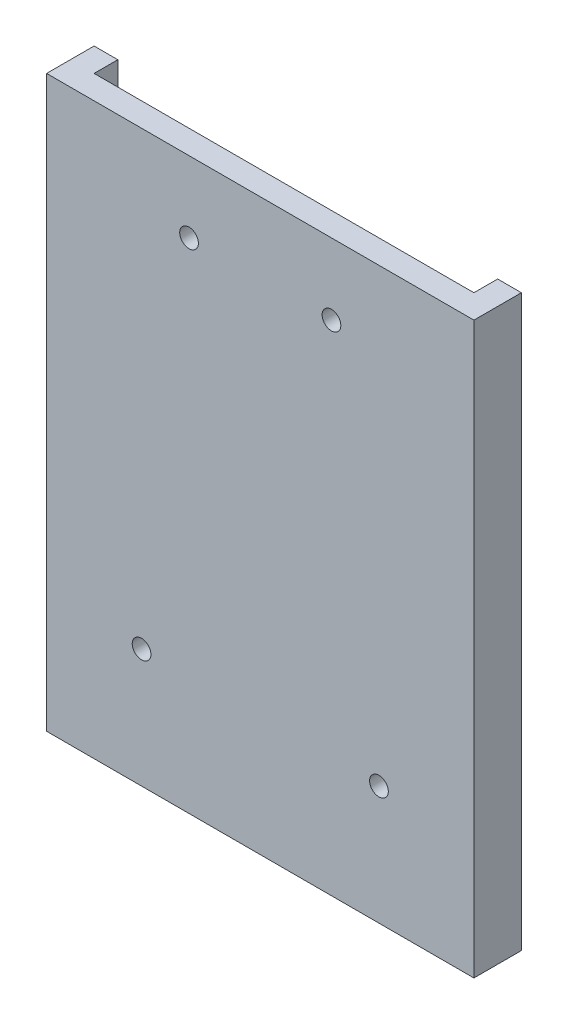
ISO-10303-21;
HEADER;
FILE_DESCRIPTION(('STEP AP214'),'2;1');
FILE_NAME('part.step','',(''),(''),'','','');
FILE_SCHEMA(('AUTOMOTIVE_DESIGN { 1 0 10303 214 1 1 1 1 }'));
ENDSEC;
DATA;
#1=APPLICATION_CONTEXT('core data for automotive mechanical design processes');
#2=APPLICATION_PROTOCOL_DEFINITION('international standard','automotive_design',2000,#1);
#3=PRODUCT_CONTEXT('',#1,'mechanical');
#4=PRODUCT('Part','Part','',(#3));
#5=PRODUCT_RELATED_PRODUCT_CATEGORY('part','',(#4));
#6=PRODUCT_DEFINITION_FORMATION('','',#4);
#7=PRODUCT_DEFINITION_CONTEXT('part definition',#1,'design');
#8=PRODUCT_DEFINITION('design','',#6,#7);
#9=PRODUCT_DEFINITION_SHAPE('','',#8);
#10=(LENGTH_UNIT() NAMED_UNIT(*) SI_UNIT(.MILLI.,.METRE.));
#11=(NAMED_UNIT(*) PLANE_ANGLE_UNIT() SI_UNIT($,.RADIAN.));
#12=(NAMED_UNIT(*) SI_UNIT($,.STERADIAN.) SOLID_ANGLE_UNIT());
#13=UNCERTAINTY_MEASURE_WITH_UNIT(LENGTH_MEASURE(1.E-05),#10,'distance_accuracy_value','');
#14=(GEOMETRIC_REPRESENTATION_CONTEXT(3) GLOBAL_UNCERTAINTY_ASSIGNED_CONTEXT((#13)) GLOBAL_UNIT_ASSIGNED_CONTEXT((#10,
#11,#12)) REPRESENTATION_CONTEXT('',''));
#15=CARTESIAN_POINT('',(0.,0.,0.));
#16=DIRECTION('',(0.,0.,1.));
#17=DIRECTION('',(1.,0.,0.));
#18=AXIS2_PLACEMENT_3D('',#15,#16,#17);
#19=CARTESIAN_POINT('',(28.575,76.2,-3.175));
#20=DIRECTION('',(-1.,0.,0.));
#21=DIRECTION('',(0.,0.,1.));
#22=AXIS2_PLACEMENT_3D('',#19,#20,#21);
#23=PLANE('',#22);
#24=DIRECTION('',(0.,0.,-1.));
#25=VECTOR('',#24,1.);
#26=CARTESIAN_POINT('',(28.575,0.,-3.175));
#27=LINE('',#26,#25);
#28=CARTESIAN_POINT('',(28.575,0.,3.175));
#29=VERTEX_POINT('',#28);
#30=CARTESIAN_POINT('',(28.575,0.,-3.175));
#31=VERTEX_POINT('',#30);
#32=EDGE_CURVE('E135',#29,#31,#27,.T.);
#33=ORIENTED_EDGE('',*,*,#32,.T.);
#34=DIRECTION('',(0.,-1.,0.));
#35=VECTOR('',#34,1.);
#36=CARTESIAN_POINT('',(28.575,76.2,-3.175));
#37=LINE('',#36,#35);
#38=CARTESIAN_POINT('',(28.575,76.2,-3.175));
#39=VERTEX_POINT('',#38);
#40=EDGE_CURVE('E12',#39,#31,#37,.T.);
#41=ORIENTED_EDGE('',*,*,#40,.F.);
#42=DIRECTION('',(0.,0.,-1.));
#43=VECTOR('',#42,1.);
#44=CARTESIAN_POINT('',(28.575,76.2,-3.175));
#45=LINE('',#44,#43);
#46=CARTESIAN_POINT('',(28.575,76.2,3.175));
#47=VERTEX_POINT('',#46);
#48=EDGE_CURVE('E137',#47,#39,#45,.T.);
#49=ORIENTED_EDGE('',*,*,#48,.F.);
#50=DIRECTION('',(0.,-1.,0.));
#51=VECTOR('',#50,1.);
#52=CARTESIAN_POINT('',(28.575,76.2,3.175));
#53=LINE('',#52,#51);
#54=EDGE_CURVE('E144',#47,#29,#53,.T.);
#55=ORIENTED_EDGE('',*,*,#54,.T.);
#56=EDGE_LOOP('',(#33,#41,#49,#55));
#57=FACE_BOUND('',#56,.T.);
#58=ADVANCED_FACE('F35',(#57),#23,.F.);
#59=CARTESIAN_POINT('',(-28.575,76.2,-3.175));
#60=DIRECTION('',(0.,0.,1.));
#61=DIRECTION('',(1.,0.,0.));
#62=AXIS2_PLACEMENT_3D('',#59,#60,#61);
#63=PLANE('',#62);
#64=DIRECTION('',(-1.,0.,0.));
#65=VECTOR('',#64,1.);
#66=CARTESIAN_POINT('',(-28.575,76.2,-3.175));
#67=LINE('',#66,#65);
#68=CARTESIAN_POINT('',(-25.4,76.2,-3.175));
#69=VERTEX_POINT('',#68);
#70=CARTESIAN_POINT('',(-28.575,76.2,-3.175));
#71=VERTEX_POINT('',#70);
#72=EDGE_CURVE('E139',#69,#71,#67,.T.);
#73=ORIENTED_EDGE('',*,*,#72,.F.);
#74=DIRECTION('',(0.,1.,0.));
#75=VECTOR('',#74,1.);
#76=CARTESIAN_POINT('',(-25.4,-50.8991220454734,-3.175));
#77=LINE('',#76,#75);
#78=CARTESIAN_POINT('',(-25.4,3.175,-3.175));
#79=VERTEX_POINT('',#78);
#80=EDGE_CURVE('E130',#79,#69,#77,.T.);
#81=ORIENTED_EDGE('',*,*,#80,.F.);
#82=DIRECTION('',(1.,0.,0.));
#83=VECTOR('',#82,1.);
#84=CARTESIAN_POINT('',(-25.4,3.175,-3.175));
#85=LINE('',#84,#83);
#86=CARTESIAN_POINT('',(25.4,3.175,-3.175));
#87=VERTEX_POINT('',#86);
#88=EDGE_CURVE('E196',#79,#87,#85,.T.);
#89=ORIENTED_EDGE('',*,*,#88,.T.);
#90=DIRECTION('',(0.,1.,0.));
#91=VECTOR('',#90,1.);
#92=CARTESIAN_POINT('',(25.4,-50.8991220454734,-3.175));
#93=LINE('',#92,#91);
#94=CARTESIAN_POINT('',(25.4,76.2,-3.175));
#95=VERTEX_POINT('',#94);
#96=EDGE_CURVE('E118',#87,#95,#93,.T.);
#97=ORIENTED_EDGE('',*,*,#96,.T.);
#98=EDGE_CURVE('E86',#39,#95,#67,.T.);
#99=ORIENTED_EDGE('',*,*,#98,.F.);
#100=ORIENTED_EDGE('',*,*,#40,.T.);
#101=DIRECTION('',(-1.,0.,0.));
#102=VECTOR('',#101,1.);
#103=CARTESIAN_POINT('',(-28.575,0.,-3.175));
#104=LINE('',#103,#102);
#105=CARTESIAN_POINT('',(-28.575,0.,-3.175));
#106=VERTEX_POINT('',#105);
#107=EDGE_CURVE('E147',#31,#106,#104,.T.);
#108=ORIENTED_EDGE('',*,*,#107,.T.);
#109=DIRECTION('',(0.,-1.,0.));
#110=VECTOR('',#109,1.);
#111=CARTESIAN_POINT('',(-28.575,76.2,-3.175));
#112=LINE('',#111,#110);
#113=EDGE_CURVE('E42',#71,#106,#112,.T.);
#114=ORIENTED_EDGE('',*,*,#113,.F.);
#115=EDGE_LOOP('',(#73,#81,#89,#97,#99,#100,#108,#114));
#116=FACE_BOUND('',#115,.T.);
#117=ADVANCED_FACE('F177',(#116),#63,.F.);
#118=CARTESIAN_POINT('',(-28.575,76.2,-3.175));
#119=DIRECTION('',(1.,0.,0.));
#120=DIRECTION('',(0.,0.,-1.));
#121=AXIS2_PLACEMENT_3D('',#118,#119,#120);
#122=PLANE('',#121);
#123=DIRECTION('',(0.,0.,1.));
#124=VECTOR('',#123,1.);
#125=CARTESIAN_POINT('',(-28.575,0.,-3.175));
#126=LINE('',#125,#124);
#127=CARTESIAN_POINT('',(-28.575,0.,3.175));
#128=VERTEX_POINT('',#127);
#129=EDGE_CURVE('E149',#106,#128,#126,.T.);
#130=ORIENTED_EDGE('',*,*,#129,.T.);
#131=DIRECTION('',(0.,-1.,0.));
#132=VECTOR('',#131,1.);
#133=CARTESIAN_POINT('',(-28.575,76.2,3.175));
#134=LINE('',#133,#132);
#135=CARTESIAN_POINT('',(-28.575,76.2,3.175));
#136=VERTEX_POINT('',#135);
#137=EDGE_CURVE('E153',#136,#128,#134,.T.);
#138=ORIENTED_EDGE('',*,*,#137,.F.);
#139=DIRECTION('',(0.,0.,1.));
#140=VECTOR('',#139,1.);
#141=CARTESIAN_POINT('',(-28.575,76.2,-3.175));
#142=LINE('',#141,#140);
#143=EDGE_CURVE('E141',#71,#136,#142,.T.);
#144=ORIENTED_EDGE('',*,*,#143,.F.);
#145=ORIENTED_EDGE('',*,*,#113,.T.);
#146=EDGE_LOOP('',(#130,#138,#144,#145));
#147=FACE_BOUND('',#146,.T.);
#148=ADVANCED_FACE('F159',(#147),#122,.F.);
#149=CARTESIAN_POINT('',(-28.575,76.2,3.175));
#150=DIRECTION('',(0.,0.,-1.));
#151=DIRECTION('',(-1.,0.,0.));
#152=AXIS2_PLACEMENT_3D('',#149,#150,#151);
#153=PLANE('',#152);
#154=CARTESIAN_POINT('',(-15.875,15.875,3.175));
#155=DIRECTION('',(0.,0.,-1.));
#156=DIRECTION('',(-1.,0.,0.));
#157=AXIS2_PLACEMENT_3D('',#154,#155,#156);
#158=CIRCLE('',#157,1.25);
#159=CARTESIAN_POINT('',(-17.125,15.875,3.175));
#160=VERTEX_POINT('',#159);
#161=EDGE_CURVE('E205',#160,#160,#158,.T.);
#162=ORIENTED_EDGE('',*,*,#161,.T.);
#163=EDGE_LOOP('',(#162));
#164=FACE_BOUND('',#163,.T.);
#165=CARTESIAN_POINT('',(15.875,15.875,3.175));
#166=DIRECTION('',(0.,0.,-1.));
#167=DIRECTION('',(-1.,0.,0.));
#168=AXIS2_PLACEMENT_3D('',#165,#166,#167);
#169=CIRCLE('',#168,1.25);
#170=CARTESIAN_POINT('',(14.625,15.875,3.175));
#171=VERTEX_POINT('',#170);
#172=EDGE_CURVE('E210',#171,#171,#169,.T.);
#173=ORIENTED_EDGE('',*,*,#172,.T.);
#174=EDGE_LOOP('',(#173));
#175=FACE_BOUND('',#174,.T.);
#176=CARTESIAN_POINT('',(-9.52499999999999,66.675,3.175));
#177=DIRECTION('',(0.,0.,-1.));
#178=DIRECTION('',(-1.,0.,0.));
#179=AXIS2_PLACEMENT_3D('',#176,#177,#178);
#180=CIRCLE('',#179,1.25);
#181=CARTESIAN_POINT('',(-10.775,66.675,3.175));
#182=VERTEX_POINT('',#181);
#183=EDGE_CURVE('E200',#182,#182,#180,.T.);
#184=ORIENTED_EDGE('',*,*,#183,.T.);
#185=EDGE_LOOP('',(#184));
#186=FACE_BOUND('',#185,.T.);
#187=CARTESIAN_POINT('',(9.52500000000001,66.675,3.175));
#188=DIRECTION('',(0.,0.,-1.));
#189=DIRECTION('',(-1.,0.,0.));
#190=AXIS2_PLACEMENT_3D('',#187,#188,#189);
#191=CIRCLE('',#190,1.25);
#192=CARTESIAN_POINT('',(8.27500000000001,66.675,3.175));
#193=VERTEX_POINT('',#192);
#194=EDGE_CURVE('E190',#193,#193,#191,.T.);
#195=ORIENTED_EDGE('',*,*,#194,.T.);
#196=EDGE_LOOP('',(#195));
#197=FACE_BOUND('',#196,.T.);
#198=DIRECTION('',(1.,0.,0.));
#199=VECTOR('',#198,1.);
#200=CARTESIAN_POINT('',(-28.575,0.,3.175));
#201=LINE('',#200,#199);
#202=EDGE_CURVE('E79',#128,#29,#201,.T.);
#203=ORIENTED_EDGE('',*,*,#202,.T.);
#204=ORIENTED_EDGE('',*,*,#54,.F.);
#205=DIRECTION('',(1.,0.,0.));
#206=VECTOR('',#205,1.);
#207=CARTESIAN_POINT('',(-28.575,76.2,3.175));
#208=LINE('',#207,#206);
#209=EDGE_CURVE('E58',#136,#47,#208,.T.);
#210=ORIENTED_EDGE('',*,*,#209,.F.);
#211=ORIENTED_EDGE('',*,*,#137,.T.);
#212=EDGE_LOOP('',(#203,#204,#210,#211));
#213=FACE_BOUND('',#212,.T.);
#214=ADVANCED_FACE('F168',(#164,#175,#186,#197,#213),#153,.F.);
#215=CARTESIAN_POINT('',(0.,76.2,0.));
#216=DIRECTION('',(0.,1.,0.));
#217=DIRECTION('',(0.,0.,1.));
#218=AXIS2_PLACEMENT_3D('',#215,#216,#217);
#219=PLANE('',#218);
#220=DIRECTION('',(0.,0.,1.));
#221=VECTOR('',#220,1.);
#222=CARTESIAN_POINT('',(-25.4,76.2,-3.175));
#223=LINE('',#222,#221);
#224=CARTESIAN_POINT('',(-25.4,76.2,0.));
#225=VERTEX_POINT('',#224);
#226=EDGE_CURVE('E49',#69,#225,#223,.T.);
#227=ORIENTED_EDGE('',*,*,#226,.F.);
#228=ORIENTED_EDGE('',*,*,#72,.T.);
#229=ORIENTED_EDGE('',*,*,#143,.T.);
#230=ORIENTED_EDGE('',*,*,#209,.T.);
#231=ORIENTED_EDGE('',*,*,#48,.T.);
#232=ORIENTED_EDGE('',*,*,#98,.T.);
#233=DIRECTION('',(0.,0.,-1.));
#234=VECTOR('',#233,1.);
#235=CARTESIAN_POINT('',(25.4,76.2,-3.175));
#236=LINE('',#235,#234);
#237=CARTESIAN_POINT('',(25.4,76.2,0.));
#238=VERTEX_POINT('',#237);
#239=EDGE_CURVE('E114',#238,#95,#236,.T.);
#240=ORIENTED_EDGE('',*,*,#239,.F.);
#241=DIRECTION('',(1.,0.,0.));
#242=VECTOR('',#241,1.);
#243=CARTESIAN_POINT('',(-25.4,76.2,0.));
#244=LINE('',#243,#242);
#245=EDGE_CURVE('E122',#225,#238,#244,.T.);
#246=ORIENTED_EDGE('',*,*,#245,.F.);
#247=EDGE_LOOP('',(#227,#228,#229,#230,#231,#232,#240,#246));
#248=FACE_BOUND('',#247,.T.);
#249=ADVANCED_FACE('F125',(#248),#219,.T.);
#250=CARTESIAN_POINT('',(0.,0.,0.));
#251=DIRECTION('',(0.,1.,0.));
#252=DIRECTION('',(0.,0.,1.));
#253=AXIS2_PLACEMENT_3D('',#250,#251,#252);
#254=PLANE('',#253);
#255=ORIENTED_EDGE('',*,*,#32,.F.);
#256=ORIENTED_EDGE('',*,*,#202,.F.);
#257=ORIENTED_EDGE('',*,*,#129,.F.);
#258=ORIENTED_EDGE('',*,*,#107,.F.);
#259=EDGE_LOOP('',(#255,#256,#257,#258));
#260=FACE_BOUND('',#259,.T.);
#261=ADVANCED_FACE('F164',(#260),#254,.F.);
#262=CARTESIAN_POINT('',(-25.4,-50.8991220454734,-3.175));
#263=DIRECTION('',(-1.,0.,0.));
#264=DIRECTION('',(0.,0.,1.));
#265=AXIS2_PLACEMENT_3D('',#262,#263,#264);
#266=PLANE('',#265);
#267=DIRECTION('',(0.,0.,-1.));
#268=VECTOR('',#267,1.);
#269=CARTESIAN_POINT('',(-25.4,3.175,-3.175));
#270=LINE('',#269,#268);
#271=CARTESIAN_POINT('',(-25.4,3.175,0.));
#272=VERTEX_POINT('',#271);
#273=EDGE_CURVE('E136',#272,#79,#270,.T.);
#274=ORIENTED_EDGE('',*,*,#273,.T.);
#275=ORIENTED_EDGE('',*,*,#80,.T.);
#276=ORIENTED_EDGE('',*,*,#226,.T.);
#277=DIRECTION('',(0.,1.,0.));
#278=VECTOR('',#277,1.);
#279=CARTESIAN_POINT('',(-25.4,-50.8991220454734,0.));
#280=LINE('',#279,#278);
#281=EDGE_CURVE('E119',#272,#225,#280,.T.);
#282=ORIENTED_EDGE('',*,*,#281,.F.);
#283=EDGE_LOOP('',(#274,#275,#276,#282));
#284=FACE_BOUND('',#283,.T.);
#285=ADVANCED_FACE('F250',(#284),#266,.F.);
#286=CARTESIAN_POINT('',(25.4,-50.8991220454734,-3.175));
#287=DIRECTION('',(1.,0.,0.));
#288=DIRECTION('',(0.,0.,-1.));
#289=AXIS2_PLACEMENT_3D('',#286,#287,#288);
#290=PLANE('',#289);
#291=DIRECTION('',(0.,0.,1.));
#292=VECTOR('',#291,1.);
#293=CARTESIAN_POINT('',(25.4,3.175,-3.175));
#294=LINE('',#293,#292);
#295=CARTESIAN_POINT('',(25.4,3.175,0.));
#296=VERTEX_POINT('',#295);
#297=EDGE_CURVE('E115',#87,#296,#294,.T.);
#298=ORIENTED_EDGE('',*,*,#297,.T.);
#299=DIRECTION('',(0.,1.,0.));
#300=VECTOR('',#299,1.);
#301=CARTESIAN_POINT('',(25.4,-50.8991220454734,0.));
#302=LINE('',#301,#300);
#303=EDGE_CURVE('E109',#296,#238,#302,.T.);
#304=ORIENTED_EDGE('',*,*,#303,.T.);
#305=ORIENTED_EDGE('',*,*,#239,.T.);
#306=ORIENTED_EDGE('',*,*,#96,.F.);
#307=EDGE_LOOP('',(#298,#304,#305,#306));
#308=FACE_BOUND('',#307,.T.);
#309=ADVANCED_FACE('F111',(#308),#290,.F.);
#310=CARTESIAN_POINT('',(-25.4,-50.8991220454734,0.));
#311=DIRECTION('',(0.,0.,1.));
#312=DIRECTION('',(1.,0.,0.));
#313=AXIS2_PLACEMENT_3D('',#310,#311,#312);
#314=PLANE('',#313);
#315=CARTESIAN_POINT('',(-15.875,15.875,0.));
#316=DIRECTION('',(0.,0.,-1.));
#317=DIRECTION('',(-1.,0.,0.));
#318=AXIS2_PLACEMENT_3D('',#315,#316,#317);
#319=CIRCLE('',#318,1.25);
#320=CARTESIAN_POINT('',(-17.125,15.875,0.));
#321=VERTEX_POINT('',#320);
#322=EDGE_CURVE('E202',#321,#321,#319,.T.);
#323=ORIENTED_EDGE('',*,*,#322,.F.);
#324=EDGE_LOOP('',(#323));
#325=FACE_BOUND('',#324,.T.);
#326=CARTESIAN_POINT('',(15.875,15.875,0.));
#327=DIRECTION('',(0.,0.,-1.));
#328=DIRECTION('',(-1.,0.,0.));
#329=AXIS2_PLACEMENT_3D('',#326,#327,#328);
#330=CIRCLE('',#329,1.25);
#331=CARTESIAN_POINT('',(14.625,15.875,0.));
#332=VERTEX_POINT('',#331);
#333=EDGE_CURVE('E207',#332,#332,#330,.T.);
#334=ORIENTED_EDGE('',*,*,#333,.F.);
#335=EDGE_LOOP('',(#334));
#336=FACE_BOUND('',#335,.T.);
#337=CARTESIAN_POINT('',(-9.52499999999999,66.675,0.));
#338=DIRECTION('',(0.,0.,-1.));
#339=DIRECTION('',(-1.,0.,0.));
#340=AXIS2_PLACEMENT_3D('',#337,#338,#339);
#341=CIRCLE('',#340,1.25);
#342=CARTESIAN_POINT('',(-10.775,66.675,0.));
#343=VERTEX_POINT('',#342);
#344=EDGE_CURVE('E213',#343,#343,#341,.T.);
#345=ORIENTED_EDGE('',*,*,#344,.F.);
#346=EDGE_LOOP('',(#345));
#347=FACE_BOUND('',#346,.T.);
#348=CARTESIAN_POINT('',(9.52500000000001,66.675,0.));
#349=DIRECTION('',(0.,0.,-1.));
#350=DIRECTION('',(-1.,0.,0.));
#351=AXIS2_PLACEMENT_3D('',#348,#349,#350);
#352=CIRCLE('',#351,1.25);
#353=CARTESIAN_POINT('',(8.27500000000001,66.675,0.));
#354=VERTEX_POINT('',#353);
#355=EDGE_CURVE('E192',#354,#354,#352,.T.);
#356=ORIENTED_EDGE('',*,*,#355,.F.);
#357=EDGE_LOOP('',(#356));
#358=FACE_BOUND('',#357,.T.);
#359=DIRECTION('',(-1.,0.,0.));
#360=VECTOR('',#359,1.);
#361=CARTESIAN_POINT('',(-25.4,3.175,0.));
#362=LINE('',#361,#360);
#363=EDGE_CURVE('E133',#296,#272,#362,.T.);
#364=ORIENTED_EDGE('',*,*,#363,.T.);
#365=ORIENTED_EDGE('',*,*,#281,.T.);
#366=ORIENTED_EDGE('',*,*,#245,.T.);
#367=ORIENTED_EDGE('',*,*,#303,.F.);
#368=EDGE_LOOP('',(#364,#365,#366,#367));
#369=FACE_BOUND('',#368,.T.);
#370=ADVANCED_FACE('F123',(#325,#336,#347,#358,#369),#314,.F.);
#371=CARTESIAN_POINT('',(0.,3.175,0.));
#372=DIRECTION('',(0.,1.,0.));
#373=DIRECTION('',(0.,0.,1.));
#374=AXIS2_PLACEMENT_3D('',#371,#372,#373);
#375=PLANE('',#374);
#376=ORIENTED_EDGE('',*,*,#273,.F.);
#377=ORIENTED_EDGE('',*,*,#363,.F.);
#378=ORIENTED_EDGE('',*,*,#297,.F.);
#379=ORIENTED_EDGE('',*,*,#88,.F.);
#380=EDGE_LOOP('',(#376,#377,#378,#379));
#381=FACE_BOUND('',#380,.T.);
#382=ADVANCED_FACE('F231',(#381),#375,.T.);
#383=CARTESIAN_POINT('',(9.52500000000001,66.675,3.175));
#384=DIRECTION('',(0.,0.,-1.));
#385=DIRECTION('',(-1.,0.,0.));
#386=AXIS2_PLACEMENT_3D('',#383,#384,#385);
#387=CYLINDRICAL_SURFACE('',#386,1.25);
#388=ORIENTED_EDGE('',*,*,#194,.F.);
#389=EDGE_LOOP('',(#388));
#390=FACE_BOUND('',#389,.T.);
#391=ORIENTED_EDGE('',*,*,#355,.T.);
#392=EDGE_LOOP('',(#391));
#393=FACE_BOUND('',#392,.T.);
#394=ADVANCED_FACE('F225',(#390,#393),#387,.F.);
#395=CARTESIAN_POINT('',(-9.52499999999999,66.675,3.175));
#396=DIRECTION('',(0.,0.,-1.));
#397=DIRECTION('',(-1.,0.,0.));
#398=AXIS2_PLACEMENT_3D('',#395,#396,#397);
#399=CYLINDRICAL_SURFACE('',#398,1.25);
#400=ORIENTED_EDGE('',*,*,#183,.F.);
#401=EDGE_LOOP('',(#400));
#402=FACE_BOUND('',#401,.T.);
#403=ORIENTED_EDGE('',*,*,#344,.T.);
#404=EDGE_LOOP('',(#403));
#405=FACE_BOUND('',#404,.T.);
#406=ADVANCED_FACE('F221',(#402,#405),#399,.F.);
#407=CARTESIAN_POINT('',(15.875,15.875,3.175));
#408=DIRECTION('',(0.,0.,-1.));
#409=DIRECTION('',(-1.,0.,0.));
#410=AXIS2_PLACEMENT_3D('',#407,#408,#409);
#411=CYLINDRICAL_SURFACE('',#410,1.25);
#412=ORIENTED_EDGE('',*,*,#172,.F.);
#413=EDGE_LOOP('',(#412));
#414=FACE_BOUND('',#413,.T.);
#415=ORIENTED_EDGE('',*,*,#333,.T.);
#416=EDGE_LOOP('',(#415));
#417=FACE_BOUND('',#416,.T.);
#418=ADVANCED_FACE('F224',(#414,#417),#411,.F.);
#419=CARTESIAN_POINT('',(-15.875,15.875,3.175));
#420=DIRECTION('',(0.,0.,-1.));
#421=DIRECTION('',(-1.,0.,0.));
#422=AXIS2_PLACEMENT_3D('',#419,#420,#421);
#423=CYLINDRICAL_SURFACE('',#422,1.25);
#424=ORIENTED_EDGE('',*,*,#161,.F.);
#425=EDGE_LOOP('',(#424));
#426=FACE_BOUND('',#425,.T.);
#427=ORIENTED_EDGE('',*,*,#322,.T.);
#428=EDGE_LOOP('',(#427));
#429=FACE_BOUND('',#428,.T.);
#430=ADVANCED_FACE('F246',(#426,#429),#423,.F.);
#431=CLOSED_SHELL('',(#58,#117,#148,#214,#249,#261,#285,#309,#370,#382,#394,#406,#418,#430));
#432=MANIFOLD_SOLID_BREP('B2',#431);
#433=ADVANCED_BREP_SHAPE_REPRESENTATION('',(#18,#432),#14);
#434=SHAPE_DEFINITION_REPRESENTATION(#9,#433);
ENDSEC;
END-ISO-10303-21;
